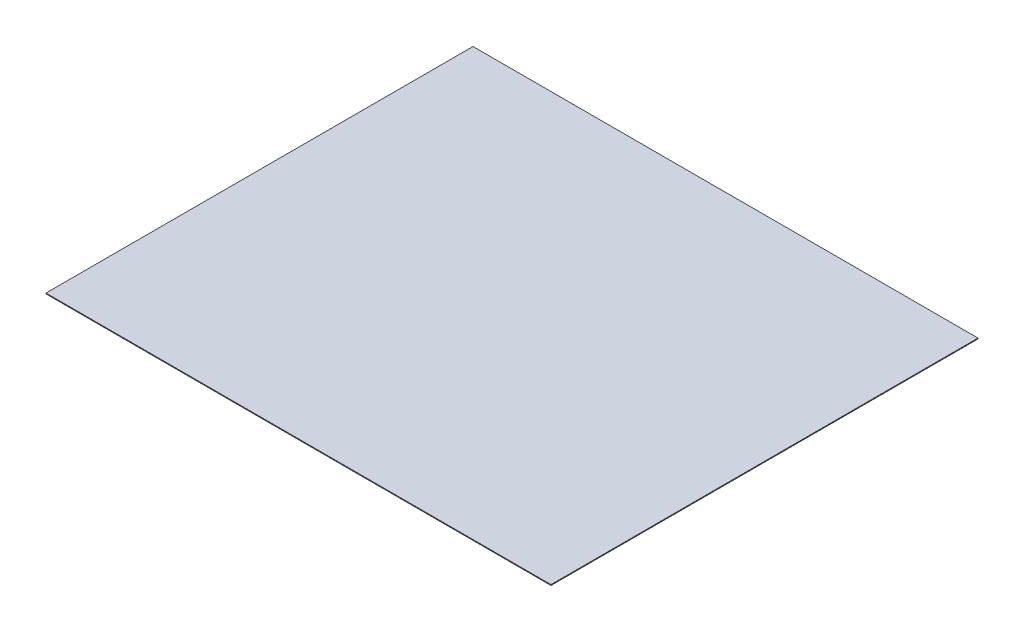
ISO-10303-21;
HEADER;
FILE_DESCRIPTION(('STEP AP214'),'2;1');
FILE_NAME('part.step','',(''),(''),'','','');
FILE_SCHEMA(('AUTOMOTIVE_DESIGN { 1 0 10303 214 1 1 1 1 }'));
ENDSEC;
DATA;
#1=APPLICATION_CONTEXT('core data for automotive mechanical design processes');
#2=APPLICATION_PROTOCOL_DEFINITION('international standard','automotive_design',2000,#1);
#3=PRODUCT_CONTEXT('',#1,'mechanical');
#4=PRODUCT('Part','Part','',(#3));
#5=PRODUCT_RELATED_PRODUCT_CATEGORY('part','',(#4));
#6=PRODUCT_DEFINITION_FORMATION('','',#4);
#7=PRODUCT_DEFINITION_CONTEXT('part definition',#1,'design');
#8=PRODUCT_DEFINITION('design','',#6,#7);
#9=PRODUCT_DEFINITION_SHAPE('','',#8);
#10=(LENGTH_UNIT() NAMED_UNIT(*) SI_UNIT(.MILLI.,.METRE.));
#11=(NAMED_UNIT(*) PLANE_ANGLE_UNIT() SI_UNIT($,.RADIAN.));
#12=(NAMED_UNIT(*) SI_UNIT($,.STERADIAN.) SOLID_ANGLE_UNIT());
#13=UNCERTAINTY_MEASURE_WITH_UNIT(LENGTH_MEASURE(1.E-05),#10,'distance_accuracy_value','');
#14=(GEOMETRIC_REPRESENTATION_CONTEXT(3) GLOBAL_UNCERTAINTY_ASSIGNED_CONTEXT((#13)) GLOBAL_UNIT_ASSIGNED_CONTEXT((#10,
#11,#12)) REPRESENTATION_CONTEXT('',''));
#15=CARTESIAN_POINT('',(0.,0.,0.));
#16=DIRECTION('',(0.,0.,1.));
#17=DIRECTION('',(1.,0.,0.));
#18=AXIS2_PLACEMENT_3D('',#15,#16,#17);
#19=CARTESIAN_POINT('',(320.5,1.,-271.));
#20=DIRECTION('',(-1.,0.,0.));
#21=DIRECTION('',(0.,0.,1.));
#22=AXIS2_PLACEMENT_3D('',#19,#20,#21);
#23=PLANE('',#22);
#24=DIRECTION('',(0.,0.,-1.));
#25=VECTOR('',#24,1.);
#26=CARTESIAN_POINT('',(320.5,0.,-271.));
#27=LINE('',#26,#25);
#28=CARTESIAN_POINT('',(320.5,0.,271.));
#29=VERTEX_POINT('',#28);
#30=CARTESIAN_POINT('',(320.5,0.,-271.));
#31=VERTEX_POINT('',#30);
#32=EDGE_CURVE('E107',#29,#31,#27,.T.);
#33=ORIENTED_EDGE('',*,*,#32,.T.);
#34=DIRECTION('',(0.,-1.,0.));
#35=VECTOR('',#34,1.);
#36=CARTESIAN_POINT('',(320.5,1.,-271.));
#37=LINE('',#36,#35);
#38=CARTESIAN_POINT('',(320.5,1.,-271.));
#39=VERTEX_POINT('',#38);
#40=EDGE_CURVE('E11',#39,#31,#37,.T.);
#41=ORIENTED_EDGE('',*,*,#40,.F.);
#42=DIRECTION('',(0.,0.,-1.));
#43=VECTOR('',#42,1.);
#44=CARTESIAN_POINT('',(320.5,1.,-271.));
#45=LINE('',#44,#43);
#46=CARTESIAN_POINT('',(320.5,1.,271.));
#47=VERTEX_POINT('',#46);
#48=EDGE_CURVE('E91',#47,#39,#45,.T.);
#49=ORIENTED_EDGE('',*,*,#48,.F.);
#50=DIRECTION('',(0.,-1.,0.));
#51=VECTOR('',#50,1.);
#52=CARTESIAN_POINT('',(320.5,1.,271.));
#53=LINE('',#52,#51);
#54=EDGE_CURVE('E103',#47,#29,#53,.T.);
#55=ORIENTED_EDGE('',*,*,#54,.T.);
#56=EDGE_LOOP('',(#33,#41,#49,#55));
#57=FACE_BOUND('',#56,.T.);
#58=ADVANCED_FACE('F39',(#57),#23,.F.);
#59=CARTESIAN_POINT('',(-320.5,1.,-271.));
#60=DIRECTION('',(0.,0.,1.));
#61=DIRECTION('',(1.,0.,0.));
#62=AXIS2_PLACEMENT_3D('',#59,#60,#61);
#63=PLANE('',#62);
#64=DIRECTION('',(-1.,0.,0.));
#65=VECTOR('',#64,1.);
#66=CARTESIAN_POINT('',(-320.5,0.,-271.));
#67=LINE('',#66,#65);
#68=CARTESIAN_POINT('',(-320.5,0.,-271.));
#69=VERTEX_POINT('',#68);
#70=EDGE_CURVE('E96',#31,#69,#67,.T.);
#71=ORIENTED_EDGE('',*,*,#70,.T.);
#72=DIRECTION('',(0.,-1.,0.));
#73=VECTOR('',#72,1.);
#74=CARTESIAN_POINT('',(-320.5,1.,-271.));
#75=LINE('',#74,#73);
#76=CARTESIAN_POINT('',(-320.5,1.,-271.));
#77=VERTEX_POINT('',#76);
#78=EDGE_CURVE('E48',#77,#69,#75,.T.);
#79=ORIENTED_EDGE('',*,*,#78,.F.);
#80=DIRECTION('',(-1.,0.,0.));
#81=VECTOR('',#80,1.);
#82=CARTESIAN_POINT('',(-320.5,1.,-271.));
#83=LINE('',#82,#81);
#84=EDGE_CURVE('E86',#39,#77,#83,.T.);
#85=ORIENTED_EDGE('',*,*,#84,.F.);
#86=ORIENTED_EDGE('',*,*,#40,.T.);
#87=EDGE_LOOP('',(#71,#79,#85,#86));
#88=FACE_BOUND('',#87,.T.);
#89=ADVANCED_FACE('F95',(#88),#63,.F.);
#90=CARTESIAN_POINT('',(-320.5,1.,-271.));
#91=DIRECTION('',(1.,0.,0.));
#92=DIRECTION('',(0.,0.,-1.));
#93=AXIS2_PLACEMENT_3D('',#90,#91,#92);
#94=PLANE('',#93);
#95=DIRECTION('',(0.,0.,1.));
#96=VECTOR('',#95,1.);
#97=CARTESIAN_POINT('',(-320.5,0.,-271.));
#98=LINE('',#97,#96);
#99=CARTESIAN_POINT('',(-320.5,0.,271.));
#100=VERTEX_POINT('',#99);
#101=EDGE_CURVE('E73',#69,#100,#98,.T.);
#102=ORIENTED_EDGE('',*,*,#101,.T.);
#103=DIRECTION('',(0.,-1.,0.));
#104=VECTOR('',#103,1.);
#105=CARTESIAN_POINT('',(-320.5,1.,271.));
#106=LINE('',#105,#104);
#107=CARTESIAN_POINT('',(-320.5,1.,271.));
#108=VERTEX_POINT('',#107);
#109=EDGE_CURVE('E98',#108,#100,#106,.T.);
#110=ORIENTED_EDGE('',*,*,#109,.F.);
#111=DIRECTION('',(0.,0.,1.));
#112=VECTOR('',#111,1.);
#113=CARTESIAN_POINT('',(-320.5,1.,-271.));
#114=LINE('',#113,#112);
#115=EDGE_CURVE('E89',#77,#108,#114,.T.);
#116=ORIENTED_EDGE('',*,*,#115,.F.);
#117=ORIENTED_EDGE('',*,*,#78,.T.);
#118=EDGE_LOOP('',(#102,#110,#116,#117));
#119=FACE_BOUND('',#118,.T.);
#120=ADVANCED_FACE('F99',(#119),#94,.F.);
#121=CARTESIAN_POINT('',(-320.5,1.,271.));
#122=DIRECTION('',(0.,0.,-1.));
#123=DIRECTION('',(-1.,0.,0.));
#124=AXIS2_PLACEMENT_3D('',#121,#122,#123);
#125=PLANE('',#124);
#126=DIRECTION('',(1.,0.,0.));
#127=VECTOR('',#126,1.);
#128=CARTESIAN_POINT('',(-320.5,0.,271.));
#129=LINE('',#128,#127);
#130=EDGE_CURVE('E79',#100,#29,#129,.T.);
#131=ORIENTED_EDGE('',*,*,#130,.T.);
#132=ORIENTED_EDGE('',*,*,#54,.F.);
#133=DIRECTION('',(1.,0.,0.));
#134=VECTOR('',#133,1.);
#135=CARTESIAN_POINT('',(-320.5,1.,271.));
#136=LINE('',#135,#134);
#137=EDGE_CURVE('E56',#108,#47,#136,.T.);
#138=ORIENTED_EDGE('',*,*,#137,.F.);
#139=ORIENTED_EDGE('',*,*,#109,.T.);
#140=EDGE_LOOP('',(#131,#132,#138,#139));
#141=FACE_BOUND('',#140,.T.);
#142=ADVANCED_FACE('F120',(#141),#125,.F.);
#143=CARTESIAN_POINT('',(0.,1.,0.));
#144=DIRECTION('',(0.,1.,0.));
#145=DIRECTION('',(0.,0.,1.));
#146=AXIS2_PLACEMENT_3D('',#143,#144,#145);
#147=PLANE('',#146);
#148=ORIENTED_EDGE('',*,*,#48,.T.);
#149=ORIENTED_EDGE('',*,*,#84,.T.);
#150=ORIENTED_EDGE('',*,*,#115,.T.);
#151=ORIENTED_EDGE('',*,*,#137,.T.);
#152=EDGE_LOOP('',(#148,#149,#150,#151));
#153=FACE_BOUND('',#152,.T.);
#154=ADVANCED_FACE('F87',(#153),#147,.T.);
#155=CARTESIAN_POINT('',(0.,0.,0.));
#156=DIRECTION('',(0.,1.,0.));
#157=DIRECTION('',(0.,0.,1.));
#158=AXIS2_PLACEMENT_3D('',#155,#156,#157);
#159=PLANE('',#158);
#160=ORIENTED_EDGE('',*,*,#32,.F.);
#161=ORIENTED_EDGE('',*,*,#130,.F.);
#162=ORIENTED_EDGE('',*,*,#101,.F.);
#163=ORIENTED_EDGE('',*,*,#70,.F.);
#164=EDGE_LOOP('',(#160,#161,#162,#163));
#165=FACE_BOUND('',#164,.T.);
#166=ADVANCED_FACE('F123',(#165),#159,.F.);
#167=CLOSED_SHELL('',(#58,#89,#120,#142,#154,#166));
#168=MANIFOLD_SOLID_BREP('B2',#167);
#169=ADVANCED_BREP_SHAPE_REPRESENTATION('',(#18,#168),#14);
#170=SHAPE_DEFINITION_REPRESENTATION(#9,#169);
ENDSEC;
END-ISO-10303-21;
